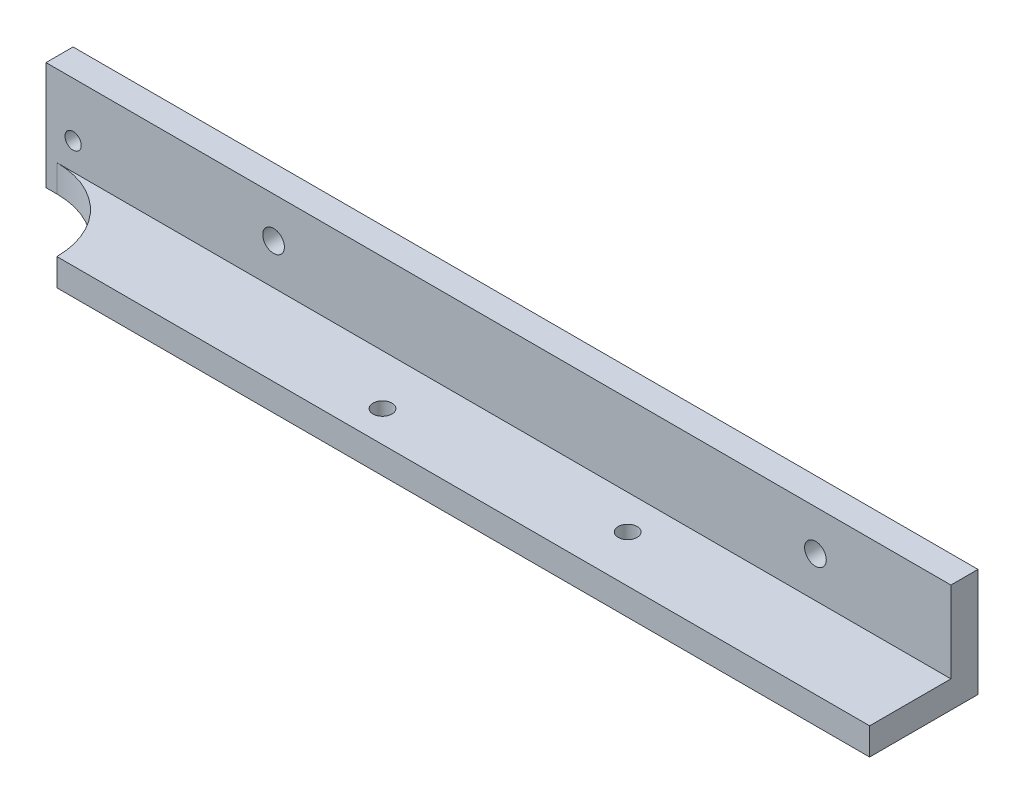
ISO-10303-21;
HEADER;
FILE_DESCRIPTION(('STEP AP214'),'2;1');
FILE_NAME('part.step','',(''),(''),'','','');
FILE_SCHEMA(('AUTOMOTIVE_DESIGN { 1 0 10303 214 1 1 1 1 }'));
ENDSEC;
DATA;
#1=APPLICATION_CONTEXT('core data for automotive mechanical design processes');
#2=APPLICATION_PROTOCOL_DEFINITION('international standard','automotive_design',2000,#1);
#3=PRODUCT_CONTEXT('',#1,'mechanical');
#4=PRODUCT('Part','Part','',(#3));
#5=PRODUCT_RELATED_PRODUCT_CATEGORY('part','',(#4));
#6=PRODUCT_DEFINITION_FORMATION('','',#4);
#7=PRODUCT_DEFINITION_CONTEXT('part definition',#1,'design');
#8=PRODUCT_DEFINITION('design','',#6,#7);
#9=PRODUCT_DEFINITION_SHAPE('','',#8);
#10=(LENGTH_UNIT() NAMED_UNIT(*) SI_UNIT(.MILLI.,.METRE.));
#11=(NAMED_UNIT(*) PLANE_ANGLE_UNIT() SI_UNIT($,.RADIAN.));
#12=(NAMED_UNIT(*) SI_UNIT($,.STERADIAN.) SOLID_ANGLE_UNIT());
#13=UNCERTAINTY_MEASURE_WITH_UNIT(LENGTH_MEASURE(1.E-05),#10,'distance_accuracy_value','');
#14=(GEOMETRIC_REPRESENTATION_CONTEXT(3) GLOBAL_UNCERTAINTY_ASSIGNED_CONTEXT((#13)) GLOBAL_UNIT_ASSIGNED_CONTEXT((#10,
#11,#12)) REPRESENTATION_CONTEXT('',''));
#15=CARTESIAN_POINT('',(0.,0.,0.));
#16=DIRECTION('',(0.,0.,1.));
#17=DIRECTION('',(1.,0.,0.));
#18=AXIS2_PLACEMENT_3D('',#15,#16,#17);
#19=CARTESIAN_POINT('',(-15.,-5.,0.));
#20=DIRECTION('',(0.,-1.,0.));
#21=DIRECTION('',(0.,0.,-1.));
#22=AXIS2_PLACEMENT_3D('',#19,#20,#21);
#23=CYLINDRICAL_SURFACE('',#22,15.);
#24=DIRECTION('',(0.,1.,0.));
#25=VECTOR('',#24,1.);
#26=CARTESIAN_POINT('',(0.,-5.,0.));
#27=LINE('',#26,#25);
#28=CARTESIAN_POINT('',(0.,-5.,0.));
#29=VERTEX_POINT('',#28);
#30=CARTESIAN_POINT('',(0.,0.,0.));
#31=VERTEX_POINT('',#30);
#32=EDGE_CURVE('E106',#29,#31,#27,.T.);
#33=ORIENTED_EDGE('',*,*,#32,.T.);
#34=CARTESIAN_POINT('',(-15.,0.,0.));
#35=DIRECTION('',(0.,-1.,0.));
#36=DIRECTION('',(0.,0.,-1.));
#37=AXIS2_PLACEMENT_3D('',#34,#35,#36);
#38=CIRCLE('',#37,15.);
#39=CARTESIAN_POINT('',(-15.,0.,-15.));
#40=VERTEX_POINT('',#39);
#41=EDGE_CURVE('E46',#31,#40,#38,.F.);
#42=ORIENTED_EDGE('',*,*,#41,.T.);
#43=DIRECTION('',(0.,-1.,0.));
#44=VECTOR('',#43,1.);
#45=CARTESIAN_POINT('',(-15.,15.,-15.));
#46=LINE('',#45,#44);
#47=CARTESIAN_POINT('',(-15.,-5.,-15.));
#48=VERTEX_POINT('',#47);
#49=EDGE_CURVE('E201',#48,#40,#46,.F.);
#50=ORIENTED_EDGE('',*,*,#49,.F.);
#51=CARTESIAN_POINT('',(-15.,-5.,0.));
#52=DIRECTION('',(0.,-1.,0.));
#53=DIRECTION('',(0.,0.,-1.));
#54=AXIS2_PLACEMENT_3D('',#51,#52,#53);
#55=CIRCLE('',#54,15.);
#56=EDGE_CURVE('E11',#48,#29,#55,.T.);
#57=ORIENTED_EDGE('',*,*,#56,.T.);
#58=EDGE_LOOP('',(#33,#42,#50,#57));
#59=FACE_BOUND('',#58,.T.);
#60=ADVANCED_FACE('F38',(#59),#23,.F.);
#61=CARTESIAN_POINT('',(0.,0.,0.));
#62=DIRECTION('',(0.,-1.,0.));
#63=DIRECTION('',(0.,0.,-1.));
#64=AXIS2_PLACEMENT_3D('',#61,#62,#63);
#65=PLANE('',#64);
#66=CARTESIAN_POINT('',(54.35,0.,-5.75));
#67=DIRECTION('',(0.,1.,0.));
#68=DIRECTION('',(0.,0.,1.));
#69=AXIS2_PLACEMENT_3D('',#66,#67,#68);
#70=CIRCLE('',#69,1.75);
#71=CARTESIAN_POINT('',(54.35,0.,-4.));
#72=VERTEX_POINT('',#71);
#73=EDGE_CURVE('E144',#72,#72,#70,.T.);
#74=ORIENTED_EDGE('',*,*,#73,.F.);
#75=EDGE_LOOP('',(#74));
#76=FACE_BOUND('',#75,.T.);
#77=CARTESIAN_POINT('',(96.7,0.,-8.65));
#78=DIRECTION('',(0.,1.,0.));
#79=DIRECTION('',(0.,0.,1.));
#80=AXIS2_PLACEMENT_3D('',#77,#78,#79);
#81=CIRCLE('',#80,1.75);
#82=CARTESIAN_POINT('',(96.7,0.,-6.9));
#83=VERTEX_POINT('',#82);
#84=EDGE_CURVE('E138',#83,#83,#81,.T.);
#85=ORIENTED_EDGE('',*,*,#84,.F.);
#86=EDGE_LOOP('',(#85));
#87=FACE_BOUND('',#86,.T.);
#88=DIRECTION('',(1.,0.,0.));
#89=VECTOR('',#88,1.);
#90=CARTESIAN_POINT('',(0.,0.,-15.));
#91=LINE('',#90,#89);
#92=CARTESIAN_POINT('',(150.,0.,-15.));
#93=VERTEX_POINT('',#92);
#94=EDGE_CURVE('E53',#40,#93,#91,.T.);
#95=ORIENTED_EDGE('',*,*,#94,.F.);
#96=ORIENTED_EDGE('',*,*,#41,.F.);
#97=DIRECTION('',(1.,0.,0.));
#98=VECTOR('',#97,1.);
#99=CARTESIAN_POINT('',(0.,0.,0.));
#100=LINE('',#99,#98);
#101=CARTESIAN_POINT('',(150.,0.,0.));
#102=VERTEX_POINT('',#101);
#103=EDGE_CURVE('E186',#31,#102,#100,.T.);
#104=ORIENTED_EDGE('',*,*,#103,.T.);
#105=DIRECTION('',(0.,0.,-1.));
#106=VECTOR('',#105,1.);
#107=CARTESIAN_POINT('',(150.,0.,0.));
#108=LINE('',#107,#106);
#109=EDGE_CURVE('E191',#102,#93,#108,.T.);
#110=ORIENTED_EDGE('',*,*,#109,.T.);
#111=EDGE_LOOP('',(#95,#96,#104,#110));
#112=FACE_BOUND('',#111,.T.);
#113=ADVANCED_FACE('F225',(#76,#87,#112),#65,.F.);
#114=CARTESIAN_POINT('',(0.,-5.,-20.));
#115=DIRECTION('',(0.,0.,-1.));
#116=DIRECTION('',(-1.,0.,0.));
#117=AXIS2_PLACEMENT_3D('',#114,#115,#116);
#118=PLANE('',#117);
#119=CARTESIAN_POINT('',(-12.,5.,-20.));
#120=DIRECTION('',(0.,0.,1.));
#121=DIRECTION('',(1.,0.,0.));
#122=AXIS2_PLACEMENT_3D('',#119,#120,#121);
#123=CIRCLE('',#122,1.5);
#124=CARTESIAN_POINT('',(-10.5,5.,-20.));
#125=VERTEX_POINT('',#124);
#126=EDGE_CURVE('E124',#125,#125,#123,.T.);
#127=ORIENTED_EDGE('',*,*,#126,.T.);
#128=EDGE_LOOP('',(#127));
#129=FACE_BOUND('',#128,.T.);
#130=CARTESIAN_POINT('',(25.,7.5,-20.));
#131=DIRECTION('',(0.,0.,1.));
#132=DIRECTION('',(1.,0.,0.));
#133=AXIS2_PLACEMENT_3D('',#130,#131,#132);
#134=CIRCLE('',#133,2.);
#135=CARTESIAN_POINT('',(27.,7.5,-20.));
#136=VERTEX_POINT('',#135);
#137=EDGE_CURVE('E155',#136,#136,#134,.T.);
#138=ORIENTED_EDGE('',*,*,#137,.T.);
#139=EDGE_LOOP('',(#138));
#140=FACE_BOUND('',#139,.T.);
#141=CARTESIAN_POINT('',(125.,7.5,-20.));
#142=DIRECTION('',(0.,0.,1.));
#143=DIRECTION('',(1.,0.,0.));
#144=AXIS2_PLACEMENT_3D('',#141,#142,#143);
#145=CIRCLE('',#144,2.);
#146=CARTESIAN_POINT('',(127.,7.5,-20.));
#147=VERTEX_POINT('',#146);
#148=EDGE_CURVE('E163',#147,#147,#145,.T.);
#149=ORIENTED_EDGE('',*,*,#148,.T.);
#150=EDGE_LOOP('',(#149));
#151=FACE_BOUND('',#150,.T.);
#152=DIRECTION('',(-1.,0.,0.));
#153=VECTOR('',#152,1.);
#154=CARTESIAN_POINT('',(0.,-5.,-20.));
#155=LINE('',#154,#153);
#156=CARTESIAN_POINT('',(150.,-5.,-20.));
#157=VERTEX_POINT('',#156);
#158=CARTESIAN_POINT('',(-17.,-5.,-20.));
#159=VERTEX_POINT('',#158);
#160=EDGE_CURVE('E96',#157,#159,#155,.T.);
#161=ORIENTED_EDGE('',*,*,#160,.T.);
#162=DIRECTION('',(0.,-1.,0.));
#163=VECTOR('',#162,1.);
#164=CARTESIAN_POINT('',(-17.,15.,-20.));
#165=LINE('',#164,#163);
#166=CARTESIAN_POINT('',(-17.,15.,-20.));
#167=VERTEX_POINT('',#166);
#168=EDGE_CURVE('E101',#167,#159,#165,.T.);
#169=ORIENTED_EDGE('',*,*,#168,.F.);
#170=DIRECTION('',(-1.,0.,0.));
#171=VECTOR('',#170,1.);
#172=CARTESIAN_POINT('',(0.,15.,-20.));
#173=LINE('',#172,#171);
#174=CARTESIAN_POINT('',(150.,15.,-20.));
#175=VERTEX_POINT('',#174);
#176=EDGE_CURVE('E177',#175,#167,#173,.T.);
#177=ORIENTED_EDGE('',*,*,#176,.F.);
#178=DIRECTION('',(0.,1.,0.));
#179=VECTOR('',#178,1.);
#180=CARTESIAN_POINT('',(150.,-5.,-20.));
#181=LINE('',#180,#179);
#182=EDGE_CURVE('E102',#157,#175,#181,.T.);
#183=ORIENTED_EDGE('',*,*,#182,.F.);
#184=EDGE_LOOP('',(#161,#169,#177,#183));
#185=FACE_BOUND('',#184,.T.);
#186=ADVANCED_FACE('F98',(#129,#140,#151,#185),#118,.T.);
#187=CARTESIAN_POINT('',(150.,-5.,0.));
#188=DIRECTION('',(1.,0.,0.));
#189=DIRECTION('',(0.,0.,-1.));
#190=AXIS2_PLACEMENT_3D('',#187,#188,#189);
#191=PLANE('',#190);
#192=ORIENTED_EDGE('',*,*,#109,.F.);
#193=DIRECTION('',(0.,1.,0.));
#194=VECTOR('',#193,1.);
#195=CARTESIAN_POINT('',(150.,-5.,0.));
#196=LINE('',#195,#194);
#197=CARTESIAN_POINT('',(150.,-5.,0.));
#198=VERTEX_POINT('',#197);
#199=EDGE_CURVE('E202',#198,#102,#196,.T.);
#200=ORIENTED_EDGE('',*,*,#199,.F.);
#201=DIRECTION('',(0.,0.,-1.));
#202=VECTOR('',#201,1.);
#203=CARTESIAN_POINT('',(150.,-5.,0.));
#204=LINE('',#203,#202);
#205=EDGE_CURVE('E107',#198,#157,#204,.T.);
#206=ORIENTED_EDGE('',*,*,#205,.T.);
#207=ORIENTED_EDGE('',*,*,#182,.T.);
#208=DIRECTION('',(0.,0.,-1.));
#209=VECTOR('',#208,1.);
#210=CARTESIAN_POINT('',(150.,15.,-20.));
#211=LINE('',#210,#209);
#212=CARTESIAN_POINT('',(150.,15.,-15.));
#213=VERTEX_POINT('',#212);
#214=EDGE_CURVE('E173',#213,#175,#211,.T.);
#215=ORIENTED_EDGE('',*,*,#214,.F.);
#216=DIRECTION('',(0.,-1.,0.));
#217=VECTOR('',#216,1.);
#218=CARTESIAN_POINT('',(150.,15.,-15.));
#219=LINE('',#218,#217);
#220=EDGE_CURVE('E180',#213,#93,#219,.T.);
#221=ORIENTED_EDGE('',*,*,#220,.T.);
#222=EDGE_LOOP('',(#192,#200,#206,#207,#215,#221));
#223=FACE_BOUND('',#222,.T.);
#224=ADVANCED_FACE('F222',(#223),#191,.T.);
#225=CARTESIAN_POINT('',(0.,-5.,0.));
#226=DIRECTION('',(0.,0.,1.));
#227=DIRECTION('',(1.,0.,0.));
#228=AXIS2_PLACEMENT_3D('',#225,#226,#227);
#229=PLANE('',#228);
#230=ORIENTED_EDGE('',*,*,#103,.F.);
#231=ORIENTED_EDGE('',*,*,#32,.F.);
#232=DIRECTION('',(1.,0.,0.));
#233=VECTOR('',#232,1.);
#234=CARTESIAN_POINT('',(0.,-5.,0.));
#235=LINE('',#234,#233);
#236=EDGE_CURVE('E187',#29,#198,#235,.T.);
#237=ORIENTED_EDGE('',*,*,#236,.T.);
#238=ORIENTED_EDGE('',*,*,#199,.T.);
#239=EDGE_LOOP('',(#230,#231,#237,#238));
#240=FACE_BOUND('',#239,.T.);
#241=ADVANCED_FACE('F224',(#240),#229,.T.);
#242=CARTESIAN_POINT('',(0.,-5.,0.));
#243=DIRECTION('',(0.,-1.,0.));
#244=DIRECTION('',(0.,0.,-1.));
#245=AXIS2_PLACEMENT_3D('',#242,#243,#244);
#246=PLANE('',#245);
#247=CARTESIAN_POINT('',(54.35,-5.,-5.75));
#248=DIRECTION('',(0.,1.,0.));
#249=DIRECTION('',(0.,0.,1.));
#250=AXIS2_PLACEMENT_3D('',#247,#248,#249);
#251=CIRCLE('',#250,1.75);
#252=CARTESIAN_POINT('',(54.35,-5.,-4.));
#253=VERTEX_POINT('',#252);
#254=EDGE_CURVE('E139',#253,#253,#251,.T.);
#255=ORIENTED_EDGE('',*,*,#254,.T.);
#256=EDGE_LOOP('',(#255));
#257=FACE_BOUND('',#256,.T.);
#258=CARTESIAN_POINT('',(96.7,-5.,-8.65));
#259=DIRECTION('',(0.,1.,0.));
#260=DIRECTION('',(0.,0.,1.));
#261=AXIS2_PLACEMENT_3D('',#258,#259,#260);
#262=CIRCLE('',#261,1.75);
#263=CARTESIAN_POINT('',(96.7,-5.,-6.9));
#264=VERTEX_POINT('',#263);
#265=EDGE_CURVE('E148',#264,#264,#262,.T.);
#266=ORIENTED_EDGE('',*,*,#265,.T.);
#267=EDGE_LOOP('',(#266));
#268=FACE_BOUND('',#267,.T.);
#269=ORIENTED_EDGE('',*,*,#236,.F.);
#270=ORIENTED_EDGE('',*,*,#56,.F.);
#271=DIRECTION('',(1.,0.,0.));
#272=VECTOR('',#271,1.);
#273=CARTESIAN_POINT('',(-17.,-5.,-15.));
#274=LINE('',#273,#272);
#275=CARTESIAN_POINT('',(-17.,-5.,-15.));
#276=VERTEX_POINT('',#275);
#277=EDGE_CURVE('E112',#276,#48,#274,.T.);
#278=ORIENTED_EDGE('',*,*,#277,.F.);
#279=DIRECTION('',(0.,0.,1.));
#280=VECTOR('',#279,1.);
#281=CARTESIAN_POINT('',(-17.,-5.,-20.));
#282=LINE('',#281,#280);
#283=EDGE_CURVE('E109',#159,#276,#282,.T.);
#284=ORIENTED_EDGE('',*,*,#283,.F.);
#285=ORIENTED_EDGE('',*,*,#160,.F.);
#286=ORIENTED_EDGE('',*,*,#205,.F.);
#287=EDGE_LOOP('',(#269,#270,#278,#284,#285,#286));
#288=FACE_BOUND('',#287,.T.);
#289=ADVANCED_FACE('F110',(#257,#268,#288),#246,.T.);
#290=CARTESIAN_POINT('',(0.,15.,-15.));
#291=DIRECTION('',(0.,0.,-1.));
#292=DIRECTION('',(-1.,0.,0.));
#293=AXIS2_PLACEMENT_3D('',#290,#291,#292);
#294=PLANE('',#293);
#295=CARTESIAN_POINT('',(-12.,5.,-15.));
#296=DIRECTION('',(0.,0.,1.));
#297=DIRECTION('',(1.,0.,0.));
#298=AXIS2_PLACEMENT_3D('',#295,#296,#297);
#299=CIRCLE('',#298,1.5);
#300=CARTESIAN_POINT('',(-10.5,5.,-15.));
#301=VERTEX_POINT('',#300);
#302=EDGE_CURVE('E128',#301,#301,#299,.T.);
#303=ORIENTED_EDGE('',*,*,#302,.F.);
#304=EDGE_LOOP('',(#303));
#305=FACE_BOUND('',#304,.T.);
#306=CARTESIAN_POINT('',(25.,7.5,-15.));
#307=DIRECTION('',(0.,0.,1.));
#308=DIRECTION('',(1.,0.,0.));
#309=AXIS2_PLACEMENT_3D('',#306,#307,#308);
#310=CIRCLE('',#309,2.);
#311=CARTESIAN_POINT('',(27.,7.5,-15.));
#312=VERTEX_POINT('',#311);
#313=EDGE_CURVE('E159',#312,#312,#310,.T.);
#314=ORIENTED_EDGE('',*,*,#313,.F.);
#315=EDGE_LOOP('',(#314));
#316=FACE_BOUND('',#315,.T.);
#317=CARTESIAN_POINT('',(125.,7.5,-15.));
#318=DIRECTION('',(0.,0.,1.));
#319=DIRECTION('',(1.,0.,0.));
#320=AXIS2_PLACEMENT_3D('',#317,#318,#319);
#321=CIRCLE('',#320,2.);
#322=CARTESIAN_POINT('',(127.,7.5,-15.));
#323=VERTEX_POINT('',#322);
#324=EDGE_CURVE('E143',#323,#323,#321,.T.);
#325=ORIENTED_EDGE('',*,*,#324,.F.);
#326=EDGE_LOOP('',(#325));
#327=FACE_BOUND('',#326,.T.);
#328=ORIENTED_EDGE('',*,*,#277,.T.);
#329=ORIENTED_EDGE('',*,*,#49,.T.);
#330=ORIENTED_EDGE('',*,*,#94,.T.);
#331=ORIENTED_EDGE('',*,*,#220,.F.);
#332=DIRECTION('',(1.,0.,0.));
#333=VECTOR('',#332,1.);
#334=CARTESIAN_POINT('',(0.,15.,-15.));
#335=LINE('',#334,#333);
#336=CARTESIAN_POINT('',(-17.,15.,-15.));
#337=VERTEX_POINT('',#336);
#338=EDGE_CURVE('E170',#337,#213,#335,.T.);
#339=ORIENTED_EDGE('',*,*,#338,.F.);
#340=DIRECTION('',(0.,1.,0.));
#341=VECTOR('',#340,1.);
#342=CARTESIAN_POINT('',(-17.,15.,-15.));
#343=LINE('',#342,#341);
#344=EDGE_CURVE('E117',#276,#337,#343,.T.);
#345=ORIENTED_EDGE('',*,*,#344,.F.);
#346=EDGE_LOOP('',(#328,#329,#330,#331,#339,#345));
#347=FACE_BOUND('',#346,.T.);
#348=ADVANCED_FACE('F215',(#305,#316,#327,#347),#294,.F.);
#349=CARTESIAN_POINT('',(0.,15.,0.));
#350=DIRECTION('',(0.,1.,0.));
#351=DIRECTION('',(0.,0.,1.));
#352=AXIS2_PLACEMENT_3D('',#349,#350,#351);
#353=PLANE('',#352);
#354=ORIENTED_EDGE('',*,*,#176,.T.);
#355=DIRECTION('',(0.,0.,-1.));
#356=VECTOR('',#355,1.);
#357=CARTESIAN_POINT('',(-17.,15.,-20.));
#358=LINE('',#357,#356);
#359=EDGE_CURVE('E122',#337,#167,#358,.T.);
#360=ORIENTED_EDGE('',*,*,#359,.F.);
#361=ORIENTED_EDGE('',*,*,#338,.T.);
#362=ORIENTED_EDGE('',*,*,#214,.T.);
#363=EDGE_LOOP('',(#354,#360,#361,#362));
#364=FACE_BOUND('',#363,.T.);
#365=ADVANCED_FACE('F218',(#364),#353,.T.);
#366=CARTESIAN_POINT('',(125.,7.5,-20.));
#367=DIRECTION('',(0.,0.,1.));
#368=DIRECTION('',(1.,0.,0.));
#369=AXIS2_PLACEMENT_3D('',#366,#367,#368);
#370=CYLINDRICAL_SURFACE('',#369,2.);
#371=ORIENTED_EDGE('',*,*,#148,.F.);
#372=EDGE_LOOP('',(#371));
#373=FACE_BOUND('',#372,.T.);
#374=ORIENTED_EDGE('',*,*,#324,.T.);
#375=EDGE_LOOP('',(#374));
#376=FACE_BOUND('',#375,.T.);
#377=ADVANCED_FACE('F269',(#373,#376),#370,.F.);
#378=CARTESIAN_POINT('',(25.,7.5,-20.));
#379=DIRECTION('',(0.,0.,1.));
#380=DIRECTION('',(1.,0.,0.));
#381=AXIS2_PLACEMENT_3D('',#378,#379,#380);
#382=CYLINDRICAL_SURFACE('',#381,2.);
#383=ORIENTED_EDGE('',*,*,#137,.F.);
#384=EDGE_LOOP('',(#383));
#385=FACE_BOUND('',#384,.T.);
#386=ORIENTED_EDGE('',*,*,#313,.T.);
#387=EDGE_LOOP('',(#386));
#388=FACE_BOUND('',#387,.T.);
#389=ADVANCED_FACE('F260',(#385,#388),#382,.F.);
#390=CARTESIAN_POINT('',(96.7,-5.,-8.65));
#391=DIRECTION('',(0.,1.,0.));
#392=DIRECTION('',(0.,0.,1.));
#393=AXIS2_PLACEMENT_3D('',#390,#391,#392);
#394=CYLINDRICAL_SURFACE('',#393,1.75);
#395=ORIENTED_EDGE('',*,*,#265,.F.);
#396=EDGE_LOOP('',(#395));
#397=FACE_BOUND('',#396,.T.);
#398=ORIENTED_EDGE('',*,*,#84,.T.);
#399=EDGE_LOOP('',(#398));
#400=FACE_BOUND('',#399,.T.);
#401=ADVANCED_FACE('F256',(#397,#400),#394,.F.);
#402=CARTESIAN_POINT('',(54.35,-5.,-5.75));
#403=DIRECTION('',(0.,1.,0.));
#404=DIRECTION('',(0.,0.,1.));
#405=AXIS2_PLACEMENT_3D('',#402,#403,#404);
#406=CYLINDRICAL_SURFACE('',#405,1.75);
#407=ORIENTED_EDGE('',*,*,#254,.F.);
#408=EDGE_LOOP('',(#407));
#409=FACE_BOUND('',#408,.T.);
#410=ORIENTED_EDGE('',*,*,#73,.T.);
#411=EDGE_LOOP('',(#410));
#412=FACE_BOUND('',#411,.T.);
#413=ADVANCED_FACE('F259',(#409,#412),#406,.F.);
#414=CARTESIAN_POINT('',(-17.,0.,0.));
#415=DIRECTION('',(-1.,0.,0.));
#416=DIRECTION('',(0.,0.,1.));
#417=AXIS2_PLACEMENT_3D('',#414,#415,#416);
#418=PLANE('',#417);
#419=ORIENTED_EDGE('',*,*,#168,.T.);
#420=ORIENTED_EDGE('',*,*,#283,.T.);
#421=ORIENTED_EDGE('',*,*,#344,.T.);
#422=ORIENTED_EDGE('',*,*,#359,.T.);
#423=EDGE_LOOP('',(#419,#420,#421,#422));
#424=FACE_BOUND('',#423,.T.);
#425=ADVANCED_FACE('F120',(#424),#418,.T.);
#426=CARTESIAN_POINT('',(-12.,5.,-20.));
#427=DIRECTION('',(0.,0.,1.));
#428=DIRECTION('',(1.,0.,0.));
#429=AXIS2_PLACEMENT_3D('',#426,#427,#428);
#430=CYLINDRICAL_SURFACE('',#429,1.5);
#431=ORIENTED_EDGE('',*,*,#126,.F.);
#432=EDGE_LOOP('',(#431));
#433=FACE_BOUND('',#432,.T.);
#434=ORIENTED_EDGE('',*,*,#302,.T.);
#435=EDGE_LOOP('',(#434));
#436=FACE_BOUND('',#435,.T.);
#437=ADVANCED_FACE('F289',(#433,#436),#430,.F.);
#438=CLOSED_SHELL('',(#60,#113,#186,#224,#241,#289,#348,#365,#377,#389,#401,#413,#425,#437));
#439=MANIFOLD_SOLID_BREP('B2',#438);
#440=ADVANCED_BREP_SHAPE_REPRESENTATION('',(#18,#439),#14);
#441=SHAPE_DEFINITION_REPRESENTATION(#9,#440);
ENDSEC;
END-ISO-10303-21;
